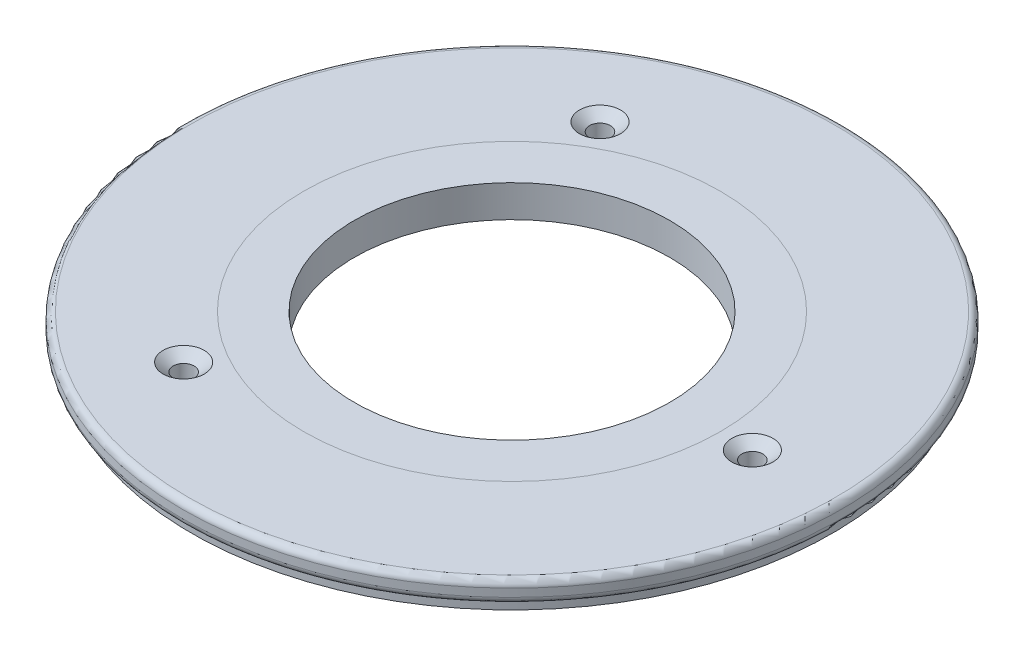
ISO-10303-21;
HEADER;
FILE_DESCRIPTION(('STEP AP214'),'2;1');
FILE_NAME('part.step','',(''),(''),'','','');
FILE_SCHEMA(('AUTOMOTIVE_DESIGN { 1 0 10303 214 1 1 1 1 }'));
ENDSEC;
DATA;
#1=APPLICATION_CONTEXT('core data for automotive mechanical design processes');
#2=APPLICATION_PROTOCOL_DEFINITION('international standard','automotive_design',2000,#1);
#3=PRODUCT_CONTEXT('',#1,'mechanical');
#4=PRODUCT('Part','Part','',(#3));
#5=PRODUCT_RELATED_PRODUCT_CATEGORY('part','',(#4));
#6=PRODUCT_DEFINITION_FORMATION('','',#4);
#7=PRODUCT_DEFINITION_CONTEXT('part definition',#1,'design');
#8=PRODUCT_DEFINITION('design','',#6,#7);
#9=PRODUCT_DEFINITION_SHAPE('','',#8);
#10=(LENGTH_UNIT() NAMED_UNIT(*) SI_UNIT(.MILLI.,.METRE.));
#11=(NAMED_UNIT(*) PLANE_ANGLE_UNIT() SI_UNIT($,.RADIAN.));
#12=(NAMED_UNIT(*) SI_UNIT($,.STERADIAN.) SOLID_ANGLE_UNIT());
#13=UNCERTAINTY_MEASURE_WITH_UNIT(LENGTH_MEASURE(1.E-05),#10,'distance_accuracy_value','');
#14=(GEOMETRIC_REPRESENTATION_CONTEXT(3) GLOBAL_UNCERTAINTY_ASSIGNED_CONTEXT((#13)) GLOBAL_UNIT_ASSIGNED_CONTEXT((#10,
#11,#12)) REPRESENTATION_CONTEXT('',''));
#15=CARTESIAN_POINT('',(0.,0.,0.));
#16=DIRECTION('',(0.,0.,1.));
#17=DIRECTION('',(1.,0.,0.));
#18=AXIS2_PLACEMENT_3D('',#15,#16,#17);
#19=CARTESIAN_POINT('',(0.,7.62,0.));
#20=DIRECTION('',(0.,1.,0.));
#21=DIRECTION('',(0.,0.,1.));
#22=AXIS2_PLACEMENT_3D('',#19,#20,#21);
#23=PLANE('',#22);
#24=CARTESIAN_POINT('',(57.15,7.62,0.));
#25=DIRECTION('',(0.,1.,0.));
#26=DIRECTION('',(0.,0.,1.));
#27=AXIS2_PLACEMENT_3D('',#24,#25,#26);
#28=CIRCLE('',#27,4.8895);
#29=CARTESIAN_POINT('',(57.15,7.62,4.8895));
#30=VERTEX_POINT('',#29);
#31=EDGE_CURVE('E76',#30,#30,#28,.T.);
#32=ORIENTED_EDGE('',*,*,#31,.F.);
#33=EDGE_LOOP('',(#32));
#34=FACE_BOUND('',#33,.T.);
#35=CARTESIAN_POINT('',(-28.5750000000002,7.62,-49.4933518262805));
#36=DIRECTION('',(0.,1.,0.));
#37=DIRECTION('',(0.,0.,1.));
#38=AXIS2_PLACEMENT_3D('',#35,#36,#37);
#39=CIRCLE('',#38,4.8895);
#40=CARTESIAN_POINT('',(-28.5750000000002,7.62,-44.6038518262805));
#41=VERTEX_POINT('',#40);
#42=EDGE_CURVE('E85',#41,#41,#39,.T.);
#43=ORIENTED_EDGE('',*,*,#42,.F.);
#44=EDGE_LOOP('',(#43));
#45=FACE_BOUND('',#44,.T.);
#46=CARTESIAN_POINT('',(-28.5749999999995,7.62,49.4933518262809));
#47=DIRECTION('',(0.,1.,0.));
#48=DIRECTION('',(0.,0.,1.));
#49=AXIS2_PLACEMENT_3D('',#46,#47,#48);
#50=CIRCLE('',#49,4.8895);
#51=CARTESIAN_POINT('',(-28.5749999999995,7.62,54.3828518262809));
#52=VERTEX_POINT('',#51);
#53=EDGE_CURVE('E94',#52,#52,#50,.T.);
#54=ORIENTED_EDGE('',*,*,#53,.F.);
#55=EDGE_LOOP('',(#54));
#56=FACE_BOUND('',#55,.T.);
#57=CARTESIAN_POINT('',(0.,7.62,0.));
#58=DIRECTION('',(0.,1.,0.));
#59=DIRECTION('',(0.,0.,1.));
#60=AXIS2_PLACEMENT_3D('',#57,#58,#59);
#61=CIRCLE('',#60,76.7715);
#62=CARTESIAN_POINT('',(0.,7.62,76.7715));
#63=VERTEX_POINT('',#62);
#64=EDGE_CURVE('E46',#63,#63,#61,.T.);
#65=ORIENTED_EDGE('',*,*,#64,.T.);
#66=EDGE_LOOP('',(#65));
#67=FACE_BOUND('',#66,.T.);
#68=CARTESIAN_POINT('',(0.,7.62,0.));
#69=DIRECTION('',(0.,1.,0.));
#70=DIRECTION('',(0.,0.,1.));
#71=AXIS2_PLACEMENT_3D('',#68,#69,#70);
#72=CIRCLE('',#71,49.53);
#73=CARTESIAN_POINT('',(0.,7.62,49.53));
#74=VERTEX_POINT('',#73);
#75=EDGE_CURVE('E10',#74,#74,#72,.F.);
#76=ORIENTED_EDGE('',*,*,#75,.T.);
#77=EDGE_LOOP('',(#76));
#78=FACE_BOUND('',#77,.T.);
#79=ADVANCED_FACE('F38',(#34,#45,#56,#67,#78),#23,.T.);
#80=CARTESIAN_POINT('',(0.,0.,0.));
#81=DIRECTION('',(0.,1.,0.));
#82=DIRECTION('',(0.,0.,1.));
#83=AXIS2_PLACEMENT_3D('',#80,#81,#82);
#84=PLANE('',#83);
#85=CARTESIAN_POINT('',(0.,0.,0.));
#86=DIRECTION('',(0.,1.,0.));
#87=DIRECTION('',(0.,0.,1.));
#88=AXIS2_PLACEMENT_3D('',#85,#86,#87);
#89=CIRCLE('',#88,37.5031);
#90=CARTESIAN_POINT('',(0.,0.,-37.5031));
#91=VERTEX_POINT('',#90);
#92=EDGE_CURVE('E65',#91,#91,#89,.T.);
#93=ORIENTED_EDGE('',*,*,#92,.T.);
#94=EDGE_LOOP('',(#93));
#95=FACE_BOUND('',#94,.T.);
#96=CARTESIAN_POINT('',(57.15,0.,0.));
#97=DIRECTION('',(0.,1.,0.));
#98=DIRECTION('',(0.,0.,1.));
#99=AXIS2_PLACEMENT_3D('',#96,#97,#98);
#100=CIRCLE('',#99,2.4892);
#101=CARTESIAN_POINT('',(57.15,0.,2.4892));
#102=VERTEX_POINT('',#101);
#103=EDGE_CURVE('E68',#102,#102,#100,.T.);
#104=ORIENTED_EDGE('',*,*,#103,.T.);
#105=EDGE_LOOP('',(#104));
#106=FACE_BOUND('',#105,.T.);
#107=CARTESIAN_POINT('',(-28.5750000000002,0.,-49.4933518262805));
#108=DIRECTION('',(0.,1.,0.));
#109=DIRECTION('',(0.,0.,1.));
#110=AXIS2_PLACEMENT_3D('',#107,#108,#109);
#111=CIRCLE('',#110,2.4892);
#112=CARTESIAN_POINT('',(-28.5750000000002,0.,-47.0041518262805));
#113=VERTEX_POINT('',#112);
#114=EDGE_CURVE('E79',#113,#113,#111,.T.);
#115=ORIENTED_EDGE('',*,*,#114,.T.);
#116=EDGE_LOOP('',(#115));
#117=FACE_BOUND('',#116,.T.);
#118=CARTESIAN_POINT('',(-28.5749999999995,0.,49.4933518262809));
#119=DIRECTION('',(0.,1.,0.));
#120=DIRECTION('',(0.,0.,1.));
#121=AXIS2_PLACEMENT_3D('',#118,#119,#120);
#122=CIRCLE('',#121,2.4892);
#123=CARTESIAN_POINT('',(-28.5749999999995,0.,51.9825518262809));
#124=VERTEX_POINT('',#123);
#125=EDGE_CURVE('E88',#124,#124,#122,.T.);
#126=ORIENTED_EDGE('',*,*,#125,.T.);
#127=EDGE_LOOP('',(#126));
#128=FACE_BOUND('',#127,.T.);
#129=CARTESIAN_POINT('',(0.,0.,0.));
#130=DIRECTION('',(0.,-1.,0.));
#131=DIRECTION('',(0.,0.,-1.));
#132=AXIS2_PLACEMENT_3D('',#129,#130,#131);
#133=CIRCLE('',#132,76.1746);
#134=CARTESIAN_POINT('',(0.,0.,-76.1746));
#135=VERTEX_POINT('',#134);
#136=EDGE_CURVE('E98',#135,#135,#133,.T.);
#137=ORIENTED_EDGE('',*,*,#136,.T.);
#138=EDGE_LOOP('',(#137));
#139=FACE_BOUND('',#138,.T.);
#140=ADVANCED_FACE('F122',(#95,#106,#117,#128,#139),#84,.F.);
#141=CARTESIAN_POINT('',(0.,7.62,0.));
#142=DIRECTION('',(0.,-1.,0.));
#143=DIRECTION('',(0.,0.,-1.));
#144=AXIS2_PLACEMENT_3D('',#141,#142,#143);
#145=CYLINDRICAL_SURFACE('',#144,78.359);
#146=CARTESIAN_POINT('',(0.,4.1275,0.));
#147=DIRECTION('',(0.,-1.,0.));
#148=DIRECTION('',(0.,0.,-1.));
#149=AXIS2_PLACEMENT_3D('',#146,#147,#148);
#150=CIRCLE('',#149,78.359);
#151=CARTESIAN_POINT('',(0.,4.1275,-78.359));
#152=VERTEX_POINT('',#151);
#153=EDGE_CURVE('E52',#152,#152,#150,.F.);
#154=CARTESIAN_POINT('',(0.,6.0325,0.));
#155=DIRECTION('',(0.,1.,0.));
#156=DIRECTION('',(0.,0.,1.));
#157=AXIS2_PLACEMENT_3D('',#154,#155,#156);
#158=CIRCLE('',#157,78.359);
#159=CARTESIAN_POINT('',(0.,6.0325,-78.359));
#160=VERTEX_POINT('',#159);
#161=EDGE_CURVE('E56',#160,#160,#158,.F.);
#162=CARTESIAN_POINT('',(0.,4.1275,-78.359));
#163=CARTESIAN_POINT('',(0.,4.14734375,-78.359));
#164=CARTESIAN_POINT('',(0.,4.1671875,-78.359));
#165=CARTESIAN_POINT('',(0.,4.206875,-78.359));
#166=CARTESIAN_POINT('',(0.,4.22671875,-78.359));
#167=CARTESIAN_POINT('',(0.,4.26640625,-78.359));
#168=CARTESIAN_POINT('',(0.,4.28625,-78.359));
#169=CARTESIAN_POINT('',(0.,4.3259375,-78.359));
#170=CARTESIAN_POINT('',(0.,4.34578125,-78.359));
#171=CARTESIAN_POINT('',(0.,4.38546875,-78.359));
#172=CARTESIAN_POINT('',(0.,4.4053125,-78.359));
#173=CARTESIAN_POINT('',(0.,4.445,-78.359));
#174=CARTESIAN_POINT('',(0.,4.46484375,-78.359));
#175=CARTESIAN_POINT('',(0.,4.50453125,-78.359));
#176=CARTESIAN_POINT('',(0.,4.524375,-78.359));
#177=CARTESIAN_POINT('',(0.,4.5640625,-78.359));
#178=CARTESIAN_POINT('',(0.,4.58390625,-78.359));
#179=CARTESIAN_POINT('',(0.,4.62359375,-78.359));
#180=CARTESIAN_POINT('',(0.,4.6434375,-78.359));
#181=CARTESIAN_POINT('',(0.,4.683125,-78.359));
#182=CARTESIAN_POINT('',(0.,4.70296875,-78.359));
#183=CARTESIAN_POINT('',(0.,4.74265625,-78.359));
#184=CARTESIAN_POINT('',(0.,4.7625,-78.359));
#185=CARTESIAN_POINT('',(0.,4.8021875,-78.359));
#186=CARTESIAN_POINT('',(0.,4.82203125,-78.359));
#187=CARTESIAN_POINT('',(0.,4.86171875,-78.359));
#188=CARTESIAN_POINT('',(0.,4.8815625,-78.359));
#189=CARTESIAN_POINT('',(0.,4.92125,-78.359));
#190=CARTESIAN_POINT('',(0.,4.94109375,-78.359));
#191=CARTESIAN_POINT('',(0.,4.98078125,-78.359));
#192=CARTESIAN_POINT('',(0.,5.000625,-78.359));
#193=CARTESIAN_POINT('',(0.,5.0403125,-78.359));
#194=CARTESIAN_POINT('',(0.,5.06015625,-78.359));
#195=CARTESIAN_POINT('',(0.,5.09984375,-78.359));
#196=CARTESIAN_POINT('',(0.,5.1196875,-78.359));
#197=CARTESIAN_POINT('',(0.,5.159375,-78.359));
#198=CARTESIAN_POINT('',(0.,5.17921875,-78.359));
#199=CARTESIAN_POINT('',(0.,5.21890625,-78.359));
#200=CARTESIAN_POINT('',(0.,5.23875,-78.359));
#201=CARTESIAN_POINT('',(0.,5.2784375,-78.359));
#202=CARTESIAN_POINT('',(0.,5.29828125,-78.359));
#203=CARTESIAN_POINT('',(0.,5.33796875,-78.359));
#204=CARTESIAN_POINT('',(0.,5.3578125,-78.359));
#205=CARTESIAN_POINT('',(0.,5.3975,-78.359));
#206=CARTESIAN_POINT('',(0.,5.41734375,-78.359));
#207=CARTESIAN_POINT('',(0.,5.45703125,-78.359));
#208=CARTESIAN_POINT('',(0.,5.476875,-78.359));
#209=CARTESIAN_POINT('',(0.,5.5165625,-78.359));
#210=CARTESIAN_POINT('',(0.,5.53640625,-78.359));
#211=CARTESIAN_POINT('',(0.,5.57609375,-78.359));
#212=CARTESIAN_POINT('',(0.,5.5959375,-78.359));
#213=CARTESIAN_POINT('',(0.,5.635625,-78.359));
#214=CARTESIAN_POINT('',(0.,5.65546875,-78.359));
#215=CARTESIAN_POINT('',(0.,5.69515625,-78.359));
#216=CARTESIAN_POINT('',(0.,5.715,-78.359));
#217=CARTESIAN_POINT('',(0.,5.7546875,-78.359));
#218=CARTESIAN_POINT('',(0.,5.77453125,-78.359));
#219=CARTESIAN_POINT('',(0.,5.81421875,-78.359));
#220=CARTESIAN_POINT('',(0.,5.8340625,-78.359));
#221=CARTESIAN_POINT('',(0.,5.87375,-78.359));
#222=CARTESIAN_POINT('',(0.,5.89359375,-78.359));
#223=CARTESIAN_POINT('',(0.,5.93328125,-78.359));
#224=CARTESIAN_POINT('',(0.,5.953125,-78.359));
#225=CARTESIAN_POINT('',(0.,5.9928125,-78.359));
#226=CARTESIAN_POINT('',(0.,6.01265625,-78.359));
#227=CARTESIAN_POINT('',(0.,6.0325,-78.359));
#228=B_SPLINE_CURVE_WITH_KNOTS('',3,(#162,#163,#164,#165,#166,#167,#168,#169,#170,#171,#172,
#173,#174,#175,#176,#177,#178,#179,#180,#181,#182,#183,#184,#185,#186,#187,#188,#189,#190,#191,
#192,#193,#194,#195,#196,#197,#198,#199,#200,#201,#202,#203,#204,#205,#206,#207,#208,#209,#210,
#211,#212,#213,#214,#215,#216,#217,#218,#219,#220,#221,#222,#223,#224,#225,#226,#227),
.UNSPECIFIED.,.F.,.F.,(4,2,2,2,2,2,2,2,2,2,2,2,2,2,2,2,2,2,2,2,2,2,2,2,2,2,2,2,2,2,2,2,4),(0.,
0.0595312499999997,0.119062499999999,0.178593749999999,0.238124999999999,0.297656249999999,
0.3571875,0.41671875,0.476249999999999,0.535781249999999,0.595312499999999,0.654843749999999,
0.714375,0.773906249999999,0.833437499999999,0.892968749999999,0.952499999999998,1.01203125,
1.0715625,1.13109375,1.190625,1.25015625,1.3096875,1.36921875,1.42875,1.48828125,1.5478125,
1.60734375,1.666875,1.72640625,1.7859375,1.84546875,1.905),.UNSPECIFIED.);
#229=EDGE_CURVE('BSEAM129',#152,#160,#228,.T.);
#230=ORIENTED_EDGE('',*,*,#153,.T.);
#231=ORIENTED_EDGE('',*,*,#161,.T.);
#232=ORIENTED_EDGE('',*,*,#229,.T.);
#233=ORIENTED_EDGE('',*,*,#229,.F.);
#234=EDGE_LOOP('',(#230,#232,#231,#233));
#235=FACE_BOUND('',#234,.T.);
#236=ADVANCED_FACE('F129',(#235),#145,.T.);
#237=ORIENTED_EDGE('',*,*,#75,.F.);
#238=EDGE_LOOP('',(#237));
#239=FACE_BOUND('',#238,.T.);
#240=CARTESIAN_POINT('',(0.,7.62,0.));
#241=DIRECTION('',(0.,1.,0.));
#242=DIRECTION('',(0.,0.,1.));
#243=AXIS2_PLACEMENT_3D('',#240,#241,#242);
#244=CIRCLE('',#243,37.5031);
#245=CARTESIAN_POINT('',(0.,7.62,-37.5031));
#246=VERTEX_POINT('',#245);
#247=EDGE_CURVE('E64',#246,#246,#244,.T.);
#248=ORIENTED_EDGE('',*,*,#247,.F.);
#249=EDGE_LOOP('',(#248));
#250=FACE_BOUND('',#249,.T.);
#251=ADVANCED_FACE('F125',(#239,#250),#23,.T.);
#252=CARTESIAN_POINT('',(0.,7.62,0.));
#253=DIRECTION('',(0.,-1.,0.));
#254=DIRECTION('',(0.,0.,-1.));
#255=AXIS2_PLACEMENT_3D('',#252,#253,#254);
#256=CYLINDRICAL_SURFACE('',#255,37.5031);
#257=CARTESIAN_POINT('',(0.,7.62,-37.5031));
#258=CARTESIAN_POINT('',(0.,7.540625,-37.5031));
#259=CARTESIAN_POINT('',(0.,7.46125,-37.5031));
#260=CARTESIAN_POINT('',(0.,7.3025,-37.5031));
#261=CARTESIAN_POINT('',(0.,7.223125,-37.5031));
#262=CARTESIAN_POINT('',(0.,7.064375,-37.5031));
#263=CARTESIAN_POINT('',(0.,6.985,-37.5031));
#264=CARTESIAN_POINT('',(0.,6.82625,-37.5031));
#265=CARTESIAN_POINT('',(0.,6.746875,-37.5031));
#266=CARTESIAN_POINT('',(0.,6.588125,-37.5031));
#267=CARTESIAN_POINT('',(0.,6.50875,-37.5031));
#268=CARTESIAN_POINT('',(0.,6.35,-37.5031));
#269=CARTESIAN_POINT('',(0.,6.270625,-37.5031));
#270=CARTESIAN_POINT('',(0.,6.111875,-37.5031));
#271=CARTESIAN_POINT('',(0.,6.0325,-37.5031));
#272=CARTESIAN_POINT('',(0.,5.87375,-37.5031));
#273=CARTESIAN_POINT('',(0.,5.794375,-37.5031));
#274=CARTESIAN_POINT('',(0.,5.635625,-37.5031));
#275=CARTESIAN_POINT('',(0.,5.55625,-37.5031));
#276=CARTESIAN_POINT('',(0.,5.3975,-37.5031));
#277=CARTESIAN_POINT('',(0.,5.318125,-37.5031));
#278=CARTESIAN_POINT('',(0.,5.159375,-37.5031));
#279=CARTESIAN_POINT('',(0.,5.08,-37.5031));
#280=CARTESIAN_POINT('',(0.,4.92125,-37.5031));
#281=CARTESIAN_POINT('',(0.,4.841875,-37.5031));
#282=CARTESIAN_POINT('',(0.,4.683125,-37.5031));
#283=CARTESIAN_POINT('',(0.,4.60375,-37.5031));
#284=CARTESIAN_POINT('',(0.,4.445,-37.5031));
#285=CARTESIAN_POINT('',(0.,4.365625,-37.5031));
#286=CARTESIAN_POINT('',(0.,4.206875,-37.5031));
#287=CARTESIAN_POINT('',(0.,4.1275,-37.5031));
#288=CARTESIAN_POINT('',(0.,3.96875,-37.5031));
#289=CARTESIAN_POINT('',(0.,3.889375,-37.5031));
#290=CARTESIAN_POINT('',(0.,3.730625,-37.5031));
#291=CARTESIAN_POINT('',(0.,3.65125,-37.5031));
#292=CARTESIAN_POINT('',(0.,3.4925,-37.5031));
#293=CARTESIAN_POINT('',(0.,3.413125,-37.5031));
#294=CARTESIAN_POINT('',(0.,3.254375,-37.5031));
#295=CARTESIAN_POINT('',(0.,3.175,-37.5031));
#296=CARTESIAN_POINT('',(0.,3.01625,-37.5031));
#297=CARTESIAN_POINT('',(0.,2.936875,-37.5031));
#298=CARTESIAN_POINT('',(0.,2.778125,-37.5031));
#299=CARTESIAN_POINT('',(0.,2.69875,-37.5031));
#300=CARTESIAN_POINT('',(0.,2.54,-37.5031));
#301=CARTESIAN_POINT('',(0.,2.460625,-37.5031));
#302=CARTESIAN_POINT('',(0.,2.301875,-37.5031));
#303=CARTESIAN_POINT('',(0.,2.2225,-37.5031));
#304=CARTESIAN_POINT('',(0.,2.06375,-37.5031));
#305=CARTESIAN_POINT('',(0.,1.984375,-37.5031));
#306=CARTESIAN_POINT('',(0.,1.825625,-37.5031));
#307=CARTESIAN_POINT('',(0.,1.74625,-37.5031));
#308=CARTESIAN_POINT('',(0.,1.5875,-37.5031));
#309=CARTESIAN_POINT('',(0.,1.508125,-37.5031));
#310=CARTESIAN_POINT('',(0.,1.349375,-37.5031));
#311=CARTESIAN_POINT('',(0.,1.27,-37.5031));
#312=CARTESIAN_POINT('',(0.,1.11125,-37.5031));
#313=CARTESIAN_POINT('',(0.,1.031875,-37.5031));
#314=CARTESIAN_POINT('',(0.,0.873125,-37.5031));
#315=CARTESIAN_POINT('',(0.,0.79375,-37.5031));
#316=CARTESIAN_POINT('',(0.,0.635,-37.5031));
#317=CARTESIAN_POINT('',(0.,0.555625,-37.5031));
#318=CARTESIAN_POINT('',(0.,0.396875,-37.5031));
#319=CARTESIAN_POINT('',(0.,0.3175,-37.5031));
#320=CARTESIAN_POINT('',(0.,0.15875,-37.5031));
#321=CARTESIAN_POINT('',(0.,0.0793749999999999,-37.5031));
#322=CARTESIAN_POINT('',(0.,0.,-37.5031));
#323=B_SPLINE_CURVE_WITH_KNOTS('',3,(#257,#258,#259,#260,#261,#262,#263,#264,#265,#266,#267,
#268,#269,#270,#271,#272,#273,#274,#275,#276,#277,#278,#279,#280,#281,#282,#283,#284,#285,#286,
#287,#288,#289,#290,#291,#292,#293,#294,#295,#296,#297,#298,#299,#300,#301,#302,#303,#304,#305,
#306,#307,#308,#309,#310,#311,#312,#313,#314,#315,#316,#317,#318,#319,#320,#321,#322),
.UNSPECIFIED.,.F.,.F.,(4,2,2,2,2,2,2,2,2,2,2,2,2,2,2,2,2,2,2,2,2,2,2,2,2,2,2,2,2,2,2,2,4),(0.,
0.238125,0.47625,0.714375000000001,0.9525,1.190625,1.42875,1.666875,1.905,2.143125,2.38125,
2.619375,2.8575,3.095625,3.33375,3.571875,3.81,4.048125,4.28625,4.524375,4.7625,5.000625,
5.23875,5.476875,5.715,5.953125,6.19125,6.429375,6.6675,6.905625,7.14375,7.381875,7.62),.UNSPECIFIED.);
#324=EDGE_CURVE('BSEAM136',#246,#91,#323,.T.);
#325=ORIENTED_EDGE('',*,*,#247,.T.);
#326=ORIENTED_EDGE('',*,*,#92,.F.);
#327=ORIENTED_EDGE('',*,*,#324,.T.);
#328=ORIENTED_EDGE('',*,*,#324,.F.);
#329=EDGE_LOOP('',(#325,#327,#326,#328));
#330=FACE_BOUND('',#329,.T.);
#331=ADVANCED_FACE('F136',(#330),#256,.F.);
#332=CARTESIAN_POINT('',(57.15,7.62,0.));
#333=DIRECTION('',(0.,1.,0.));
#334=DIRECTION('',(0.,0.,1.));
#335=AXIS2_PLACEMENT_3D('',#332,#333,#334);
#336=CYLINDRICAL_SURFACE('',#335,2.4892);
#337=ORIENTED_EDGE('',*,*,#103,.F.);
#338=EDGE_LOOP('',(#337));
#339=FACE_BOUND('',#338,.T.);
#340=CARTESIAN_POINT('',(57.15,5.60590915528517,0.));
#341=DIRECTION('',(0.,1.,0.));
#342=DIRECTION('',(0.,0.,1.));
#343=AXIS2_PLACEMENT_3D('',#340,#341,#342);
#344=CIRCLE('',#343,2.4892);
#345=CARTESIAN_POINT('',(57.15,5.60590915528517,2.4892));
#346=VERTEX_POINT('',#345);
#347=EDGE_CURVE('E73',#346,#346,#344,.T.);
#348=ORIENTED_EDGE('',*,*,#347,.T.);
#349=EDGE_LOOP('',(#348));
#350=FACE_BOUND('',#349,.T.);
#351=ADVANCED_FACE('F142',(#339,#350),#336,.F.);
#352=CARTESIAN_POINT('',(57.15,7.62,0.));
#353=DIRECTION('',(0.,1.,0.));
#354=DIRECTION('',(0.,0.,1.));
#355=AXIS2_PLACEMENT_3D('',#352,#353,#354);
#356=CONICAL_SURFACE('',#355,4.8895,0.872664625997164);
#357=ORIENTED_EDGE('',*,*,#347,.F.);
#358=EDGE_LOOP('',(#357));
#359=FACE_BOUND('',#358,.T.);
#360=ORIENTED_EDGE('',*,*,#31,.T.);
#361=EDGE_LOOP('',(#360));
#362=FACE_BOUND('',#361,.T.);
#363=ADVANCED_FACE('F176',(#359,#362),#356,.F.);
#364=CARTESIAN_POINT('',(-28.5750000000002,7.62,-49.4933518262805));
#365=DIRECTION('',(0.,1.,0.));
#366=DIRECTION('',(0.,0.,1.));
#367=AXIS2_PLACEMENT_3D('',#364,#365,#366);
#368=CYLINDRICAL_SURFACE('',#367,2.4892);
#369=ORIENTED_EDGE('',*,*,#114,.F.);
#370=EDGE_LOOP('',(#369));
#371=FACE_BOUND('',#370,.T.);
#372=CARTESIAN_POINT('',(-28.5750000000002,5.60590915528517,-49.4933518262805));
#373=DIRECTION('',(0.,1.,0.));
#374=DIRECTION('',(0.,0.,1.));
#375=AXIS2_PLACEMENT_3D('',#372,#373,#374);
#376=CIRCLE('',#375,2.4892);
#377=CARTESIAN_POINT('',(-28.5750000000002,5.60590915528517,-47.0041518262805));
#378=VERTEX_POINT('',#377);
#379=EDGE_CURVE('E82',#378,#378,#376,.T.);
#380=ORIENTED_EDGE('',*,*,#379,.T.);
#381=EDGE_LOOP('',(#380));
#382=FACE_BOUND('',#381,.T.);
#383=ADVANCED_FACE('F170',(#371,#382),#368,.F.);
#384=CARTESIAN_POINT('',(-28.5750000000002,7.62,-49.4933518262805));
#385=DIRECTION('',(0.,1.,0.));
#386=DIRECTION('',(0.,0.,1.));
#387=AXIS2_PLACEMENT_3D('',#384,#385,#386);
#388=CONICAL_SURFACE('',#387,4.8895,0.872664625997164);
#389=ORIENTED_EDGE('',*,*,#379,.F.);
#390=EDGE_LOOP('',(#389));
#391=FACE_BOUND('',#390,.T.);
#392=ORIENTED_EDGE('',*,*,#42,.T.);
#393=EDGE_LOOP('',(#392));
#394=FACE_BOUND('',#393,.T.);
#395=ADVANCED_FACE('F161',(#391,#394),#388,.F.);
#396=CARTESIAN_POINT('',(-28.5749999999995,7.62,49.4933518262809));
#397=DIRECTION('',(0.,1.,0.));
#398=DIRECTION('',(0.,0.,1.));
#399=AXIS2_PLACEMENT_3D('',#396,#397,#398);
#400=CYLINDRICAL_SURFACE('',#399,2.4892);
#401=ORIENTED_EDGE('',*,*,#125,.F.);
#402=EDGE_LOOP('',(#401));
#403=FACE_BOUND('',#402,.T.);
#404=CARTESIAN_POINT('',(-28.5749999999995,5.60590915528517,49.4933518262809));
#405=DIRECTION('',(0.,1.,0.));
#406=DIRECTION('',(0.,0.,1.));
#407=AXIS2_PLACEMENT_3D('',#404,#405,#406);
#408=CIRCLE('',#407,2.4892);
#409=CARTESIAN_POINT('',(-28.5749999999995,5.60590915528517,51.9825518262809));
#410=VERTEX_POINT('',#409);
#411=EDGE_CURVE('E91',#410,#410,#408,.T.);
#412=ORIENTED_EDGE('',*,*,#411,.T.);
#413=EDGE_LOOP('',(#412));
#414=FACE_BOUND('',#413,.T.);
#415=ADVANCED_FACE('F118',(#403,#414),#400,.F.);
#416=CARTESIAN_POINT('',(-28.5749999999995,7.62,49.4933518262809));
#417=DIRECTION('',(0.,1.,0.));
#418=DIRECTION('',(0.,0.,1.));
#419=AXIS2_PLACEMENT_3D('',#416,#417,#418);
#420=CONICAL_SURFACE('',#419,4.8895,0.872664625997164);
#421=ORIENTED_EDGE('',*,*,#411,.F.);
#422=EDGE_LOOP('',(#421));
#423=FACE_BOUND('',#422,.T.);
#424=ORIENTED_EDGE('',*,*,#53,.T.);
#425=EDGE_LOOP('',(#424));
#426=FACE_BOUND('',#425,.T.);
#427=ADVANCED_FACE('F109',(#423,#426),#420,.F.);
#428=CARTESIAN_POINT('',(0.,2.54,0.));
#429=DIRECTION('',(0.,-1.,0.));
#430=DIRECTION('',(0.,0.,-1.));
#431=AXIS2_PLACEMENT_3D('',#428,#429,#430);
#432=PLANE('',#431);
#433=CARTESIAN_POINT('',(0.,2.54,0.));
#434=DIRECTION('',(0.,-1.,0.));
#435=DIRECTION('',(0.,0.,-1.));
#436=AXIS2_PLACEMENT_3D('',#433,#434,#435);
#437=CIRCLE('',#436,76.7715);
#438=CARTESIAN_POINT('',(0.,2.54,-76.7715));
#439=VERTEX_POINT('',#438);
#440=EDGE_CURVE('E61',#439,#439,#437,.T.);
#441=ORIENTED_EDGE('',*,*,#440,.T.);
#442=EDGE_LOOP('',(#441));
#443=FACE_BOUND('',#442,.T.);
#444=CARTESIAN_POINT('',(0.,2.54,0.));
#445=DIRECTION('',(0.,-1.,0.));
#446=DIRECTION('',(0.,0.,-1.));
#447=AXIS2_PLACEMENT_3D('',#444,#445,#446);
#448=CIRCLE('',#447,76.1746);
#449=CARTESIAN_POINT('',(0.,2.54,-76.1746));
#450=VERTEX_POINT('',#449);
#451=EDGE_CURVE('E97',#450,#450,#448,.T.);
#452=ORIENTED_EDGE('',*,*,#451,.F.);
#453=EDGE_LOOP('',(#452));
#454=FACE_BOUND('',#453,.T.);
#455=ADVANCED_FACE('F107',(#443,#454),#432,.T.);
#456=CARTESIAN_POINT('',(0.,2.54,0.));
#457=DIRECTION('',(0.,-1.,0.));
#458=DIRECTION('',(0.,0.,-1.));
#459=AXIS2_PLACEMENT_3D('',#456,#457,#458);
#460=CYLINDRICAL_SURFACE('',#459,76.1746);
#461=ORIENTED_EDGE('',*,*,#451,.T.);
#462=EDGE_LOOP('',(#461));
#463=FACE_BOUND('',#462,.T.);
#464=ORIENTED_EDGE('',*,*,#136,.F.);
#465=EDGE_LOOP('',(#464));
#466=FACE_BOUND('',#465,.T.);
#467=ADVANCED_FACE('F104',(#463,#466),#460,.T.);
#468=CARTESIAN_POINT('',(0.,4.1275,0.));
#469=DIRECTION('',(0.,-1.,0.));
#470=DIRECTION('',(0.,0.,-1.));
#471=AXIS2_PLACEMENT_3D('',#468,#469,#470);
#472=TOROIDAL_SURFACE('',#471,76.7715,1.5875);
#473=ORIENTED_EDGE('',*,*,#153,.F.);
#474=EDGE_LOOP('',(#473));
#475=FACE_BOUND('',#474,.T.);
#476=ORIENTED_EDGE('',*,*,#440,.F.);
#477=EDGE_LOOP('',(#476));
#478=FACE_BOUND('',#477,.T.);
#479=ADVANCED_FACE('F116',(#475,#478),#472,.T.);
#480=CARTESIAN_POINT('',(0.,6.0325,0.));
#481=DIRECTION('',(0.,1.,0.));
#482=DIRECTION('',(0.,0.,1.));
#483=AXIS2_PLACEMENT_3D('',#480,#481,#482);
#484=TOROIDAL_SURFACE('',#483,76.7715,1.5875);
#485=ORIENTED_EDGE('',*,*,#161,.F.);
#486=EDGE_LOOP('',(#485));
#487=FACE_BOUND('',#486,.T.);
#488=ORIENTED_EDGE('',*,*,#64,.F.);
#489=EDGE_LOOP('',(#488));
#490=FACE_BOUND('',#489,.T.);
#491=ADVANCED_FACE('F40',(#487,#490),#484,.T.);
#492=CLOSED_SHELL('',(#79,#140,#236,#251,#331,#351,#363,#383,#395,#415,#427,#455,#467,#479,#491));
#493=MANIFOLD_SOLID_BREP('B2',#492);
#494=ADVANCED_BREP_SHAPE_REPRESENTATION('',(#18,#493),#14);
#495=SHAPE_DEFINITION_REPRESENTATION(#9,#494);
ENDSEC;
END-ISO-10303-21;
